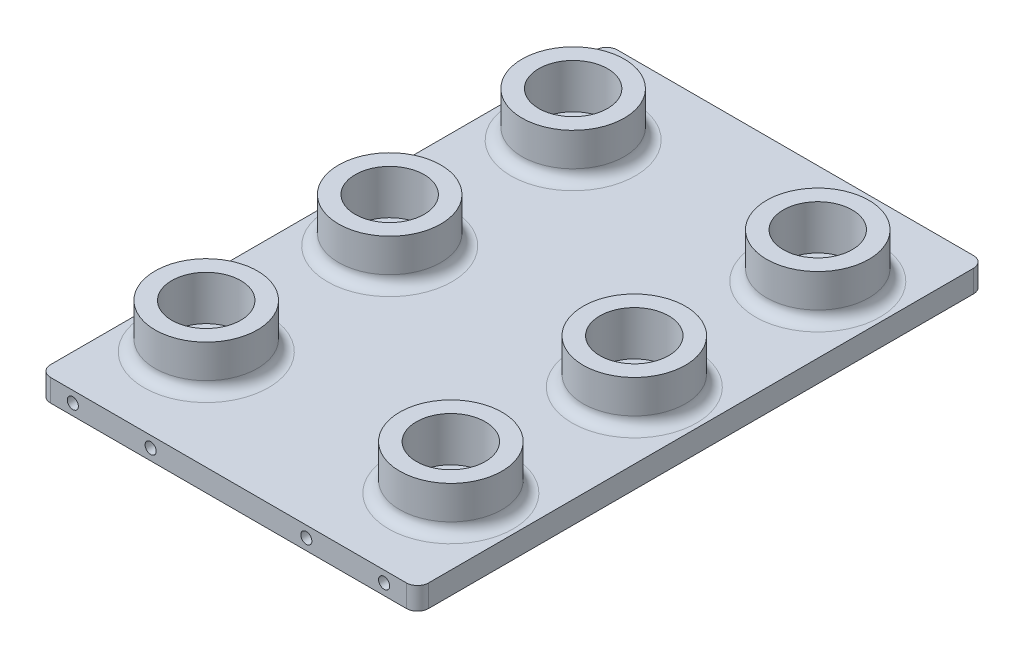
ISO-10303-21;
HEADER;
FILE_DESCRIPTION(('STEP AP214'),'2;1');
FILE_NAME('part.step','',(''),(''),'','','');
FILE_SCHEMA(('AUTOMOTIVE_DESIGN { 1 0 10303 214 1 1 1 1 }'));
ENDSEC;
DATA;
#1=APPLICATION_CONTEXT('core data for automotive mechanical design processes');
#2=APPLICATION_PROTOCOL_DEFINITION('international standard','automotive_design',2000,#1);
#3=PRODUCT_CONTEXT('',#1,'mechanical');
#4=PRODUCT('Part','Part','',(#3));
#5=PRODUCT_RELATED_PRODUCT_CATEGORY('part','',(#4));
#6=PRODUCT_DEFINITION_FORMATION('','',#4);
#7=PRODUCT_DEFINITION_CONTEXT('part definition',#1,'design');
#8=PRODUCT_DEFINITION('design','',#6,#7);
#9=PRODUCT_DEFINITION_SHAPE('','',#8);
#10=(LENGTH_UNIT() NAMED_UNIT(*) SI_UNIT(.MILLI.,.METRE.));
#11=(NAMED_UNIT(*) PLANE_ANGLE_UNIT() SI_UNIT($,.RADIAN.));
#12=(NAMED_UNIT(*) SI_UNIT($,.STERADIAN.) SOLID_ANGLE_UNIT());
#13=UNCERTAINTY_MEASURE_WITH_UNIT(LENGTH_MEASURE(1.E-05),#10,'distance_accuracy_value','');
#14=(GEOMETRIC_REPRESENTATION_CONTEXT(3) GLOBAL_UNCERTAINTY_ASSIGNED_CONTEXT((#13)) GLOBAL_UNIT_ASSIGNED_CONTEXT((#10,
#11,#12)) REPRESENTATION_CONTEXT('',''));
#15=CARTESIAN_POINT('',(0.,0.,0.));
#16=DIRECTION('',(0.,0.,1.));
#17=DIRECTION('',(1.,0.,0.));
#18=AXIS2_PLACEMENT_3D('',#15,#16,#17);
#19=CARTESIAN_POINT('',(21.59,2.54,-32.385));
#20=DIRECTION('',(-1.,0.,0.));
#21=DIRECTION('',(0.,0.,1.));
#22=AXIS2_PLACEMENT_3D('',#19,#20,#21);
#23=PLANE('',#22);
#24=DIRECTION('',(0.,0.,-1.));
#25=VECTOR('',#24,1.);
#26=CARTESIAN_POINT('',(21.59,0.,-32.385));
#27=LINE('',#26,#25);
#28=CARTESIAN_POINT('',(21.59,0.,31.115));
#29=VERTEX_POINT('',#28);
#30=CARTESIAN_POINT('',(21.59,0.,-31.115));
#31=VERTEX_POINT('',#30);
#32=EDGE_CURVE('E269',#29,#31,#27,.T.);
#33=ORIENTED_EDGE('',*,*,#32,.T.);
#34=DIRECTION('',(0.,-1.,0.));
#35=VECTOR('',#34,1.);
#36=CARTESIAN_POINT('',(21.59,2.54,-31.115));
#37=LINE('',#36,#35);
#38=CARTESIAN_POINT('',(21.59,2.54,-31.115));
#39=VERTEX_POINT('',#38);
#40=EDGE_CURVE('E124',#31,#39,#37,.F.);
#41=ORIENTED_EDGE('',*,*,#40,.T.);
#42=DIRECTION('',(0.,0.,-1.));
#43=VECTOR('',#42,1.);
#44=CARTESIAN_POINT('',(21.59,2.54,-32.385));
#45=LINE('',#44,#43);
#46=CARTESIAN_POINT('',(21.59,2.54,31.115));
#47=VERTEX_POINT('',#46);
#48=EDGE_CURVE('E108',#47,#39,#45,.T.);
#49=ORIENTED_EDGE('',*,*,#48,.F.);
#50=DIRECTION('',(0.,-1.,0.));
#51=VECTOR('',#50,1.);
#52=CARTESIAN_POINT('',(21.59,2.54,31.115));
#53=LINE('',#52,#51);
#54=EDGE_CURVE('E121',#47,#29,#53,.T.);
#55=ORIENTED_EDGE('',*,*,#54,.T.);
#56=EDGE_LOOP('',(#33,#41,#49,#55));
#57=FACE_BOUND('',#56,.T.);
#58=ADVANCED_FACE('F37',(#57),#23,.F.);
#59=CARTESIAN_POINT('',(-21.59,2.54,-32.385));
#60=DIRECTION('',(0.,0.,1.));
#61=DIRECTION('',(1.,0.,0.));
#62=AXIS2_PLACEMENT_3D('',#59,#60,#61);
#63=PLANE('',#62);
#64=CARTESIAN_POINT('',(-17.78,1.27,-32.385));
#65=DIRECTION('',(0.,0.,1.));
#66=DIRECTION('',(1.,0.,0.));
#67=AXIS2_PLACEMENT_3D('',#64,#65,#66);
#68=CIRCLE('',#67,0.634999999999999);
#69=CARTESIAN_POINT('',(-17.145,1.27,-32.385));
#70=VERTEX_POINT('',#69);
#71=EDGE_CURVE('E246',#70,#70,#68,.T.);
#72=ORIENTED_EDGE('',*,*,#71,.T.);
#73=EDGE_LOOP('',(#72));
#74=FACE_BOUND('',#73,.T.);
#75=CARTESIAN_POINT('',(-8.89,1.27,-32.385));
#76=DIRECTION('',(0.,0.,1.));
#77=DIRECTION('',(1.,0.,0.));
#78=AXIS2_PLACEMENT_3D('',#75,#76,#77);
#79=CIRCLE('',#78,0.635000000000001);
#80=CARTESIAN_POINT('',(-8.255,1.27,-32.385));
#81=VERTEX_POINT('',#80);
#82=EDGE_CURVE('E252',#81,#81,#79,.T.);
#83=ORIENTED_EDGE('',*,*,#82,.T.);
#84=EDGE_LOOP('',(#83));
#85=FACE_BOUND('',#84,.T.);
#86=CARTESIAN_POINT('',(8.89,1.27,-32.385));
#87=DIRECTION('',(0.,0.,1.));
#88=DIRECTION('',(1.,0.,0.));
#89=AXIS2_PLACEMENT_3D('',#86,#87,#88);
#90=CIRCLE('',#89,0.635000000000001);
#91=CARTESIAN_POINT('',(9.525,1.27,-32.385));
#92=VERTEX_POINT('',#91);
#93=EDGE_CURVE('E258',#92,#92,#90,.T.);
#94=ORIENTED_EDGE('',*,*,#93,.T.);
#95=EDGE_LOOP('',(#94));
#96=FACE_BOUND('',#95,.T.);
#97=CARTESIAN_POINT('',(17.78,1.27,-32.385));
#98=DIRECTION('',(0.,0.,1.));
#99=DIRECTION('',(1.,0.,0.));
#100=AXIS2_PLACEMENT_3D('',#97,#98,#99);
#101=CIRCLE('',#100,0.634999999999999);
#102=CARTESIAN_POINT('',(18.415,1.27,-32.385));
#103=VERTEX_POINT('',#102);
#104=EDGE_CURVE('E241',#103,#103,#101,.T.);
#105=ORIENTED_EDGE('',*,*,#104,.T.);
#106=EDGE_LOOP('',(#105));
#107=FACE_BOUND('',#106,.T.);
#108=DIRECTION('',(-1.,0.,0.));
#109=VECTOR('',#108,1.);
#110=CARTESIAN_POINT('',(-21.59,2.54,-32.385));
#111=LINE('',#110,#109);
#112=CARTESIAN_POINT('',(20.32,2.54,-32.385));
#113=VERTEX_POINT('',#112);
#114=CARTESIAN_POINT('',(-20.32,2.54,-32.385));
#115=VERTEX_POINT('',#114);
#116=EDGE_CURVE('E125',#113,#115,#111,.T.);
#117=ORIENTED_EDGE('',*,*,#116,.F.);
#118=DIRECTION('',(0.,-1.,0.));
#119=VECTOR('',#118,1.);
#120=CARTESIAN_POINT('',(20.32,2.54,-32.385));
#121=LINE('',#120,#119);
#122=CARTESIAN_POINT('',(20.32,0.,-32.385));
#123=VERTEX_POINT('',#122);
#124=EDGE_CURVE('E350',#113,#123,#121,.T.);
#125=ORIENTED_EDGE('',*,*,#124,.T.);
#126=DIRECTION('',(-1.,0.,0.));
#127=VECTOR('',#126,1.);
#128=CARTESIAN_POINT('',(-21.59,0.,-32.385));
#129=LINE('',#128,#127);
#130=CARTESIAN_POINT('',(-20.32,0.,-32.385));
#131=VERTEX_POINT('',#130);
#132=EDGE_CURVE('E298',#123,#131,#129,.T.);
#133=ORIENTED_EDGE('',*,*,#132,.T.);
#134=DIRECTION('',(0.,-1.,0.));
#135=VECTOR('',#134,1.);
#136=CARTESIAN_POINT('',(-20.32,2.54,-32.385));
#137=LINE('',#136,#135);
#138=EDGE_CURVE('E348',#131,#115,#137,.F.);
#139=ORIENTED_EDGE('',*,*,#138,.T.);
#140=EDGE_LOOP('',(#117,#125,#133,#139));
#141=FACE_BOUND('',#140,.T.);
#142=ADVANCED_FACE('F170',(#74,#85,#96,#107,#141),#63,.F.);
#143=CARTESIAN_POINT('',(-21.59,2.54,-32.385));
#144=DIRECTION('',(1.,0.,0.));
#145=DIRECTION('',(0.,0.,-1.));
#146=AXIS2_PLACEMENT_3D('',#143,#144,#145);
#147=PLANE('',#146);
#148=DIRECTION('',(0.,0.,1.));
#149=VECTOR('',#148,1.);
#150=CARTESIAN_POINT('',(-21.59,0.,-32.385));
#151=LINE('',#150,#149);
#152=CARTESIAN_POINT('',(-21.59,0.,-31.115));
#153=VERTEX_POINT('',#152);
#154=CARTESIAN_POINT('',(-21.59,0.,31.115));
#155=VERTEX_POINT('',#154);
#156=EDGE_CURVE('E301',#153,#155,#151,.T.);
#157=ORIENTED_EDGE('',*,*,#156,.T.);
#158=DIRECTION('',(0.,-1.,0.));
#159=VECTOR('',#158,1.);
#160=CARTESIAN_POINT('',(-21.59,2.54,31.115));
#161=LINE('',#160,#159);
#162=CARTESIAN_POINT('',(-21.59,2.54,31.115));
#163=VERTEX_POINT('',#162);
#164=EDGE_CURVE('E143',#155,#163,#161,.F.);
#165=ORIENTED_EDGE('',*,*,#164,.T.);
#166=DIRECTION('',(0.,0.,1.));
#167=VECTOR('',#166,1.);
#168=CARTESIAN_POINT('',(-21.59,2.54,-32.385));
#169=LINE('',#168,#167);
#170=CARTESIAN_POINT('',(-21.59,2.54,-31.115));
#171=VERTEX_POINT('',#170);
#172=EDGE_CURVE('E292',#171,#163,#169,.T.);
#173=ORIENTED_EDGE('',*,*,#172,.F.);
#174=DIRECTION('',(0.,-1.,0.));
#175=VECTOR('',#174,1.);
#176=CARTESIAN_POINT('',(-21.59,2.54,-31.115));
#177=LINE('',#176,#175);
#178=EDGE_CURVE('E141',#171,#153,#177,.T.);
#179=ORIENTED_EDGE('',*,*,#178,.T.);
#180=EDGE_LOOP('',(#157,#165,#173,#179));
#181=FACE_BOUND('',#180,.T.);
#182=ADVANCED_FACE('F175',(#181),#147,.F.);
#183=CARTESIAN_POINT('',(-21.59,2.54,32.385));
#184=DIRECTION('',(0.,0.,-1.));
#185=DIRECTION('',(-1.,0.,0.));
#186=AXIS2_PLACEMENT_3D('',#183,#184,#185);
#187=PLANE('',#186);
#188=CARTESIAN_POINT('',(-17.78,1.27,32.385));
#189=DIRECTION('',(0.,0.,1.));
#190=DIRECTION('',(1.,0.,0.));
#191=AXIS2_PLACEMENT_3D('',#188,#189,#190);
#192=CIRCLE('',#191,0.634999999999999);
#193=CARTESIAN_POINT('',(-17.145,1.27,32.385));
#194=VERTEX_POINT('',#193);
#195=EDGE_CURVE('E270',#194,#194,#192,.T.);
#196=ORIENTED_EDGE('',*,*,#195,.F.);
#197=EDGE_LOOP('',(#196));
#198=FACE_BOUND('',#197,.T.);
#199=CARTESIAN_POINT('',(-8.89,1.27,32.385));
#200=DIRECTION('',(0.,0.,1.));
#201=DIRECTION('',(1.,0.,0.));
#202=AXIS2_PLACEMENT_3D('',#199,#200,#201);
#203=CIRCLE('',#202,0.635000000000001);
#204=CARTESIAN_POINT('',(-8.255,1.27,32.385));
#205=VERTEX_POINT('',#204);
#206=EDGE_CURVE('E276',#205,#205,#203,.T.);
#207=ORIENTED_EDGE('',*,*,#206,.F.);
#208=EDGE_LOOP('',(#207));
#209=FACE_BOUND('',#208,.T.);
#210=CARTESIAN_POINT('',(8.89,1.27,32.385));
#211=DIRECTION('',(0.,0.,1.));
#212=DIRECTION('',(1.,0.,0.));
#213=AXIS2_PLACEMENT_3D('',#210,#211,#212);
#214=CIRCLE('',#213,0.635000000000001);
#215=CARTESIAN_POINT('',(9.525,1.27,32.385));
#216=VERTEX_POINT('',#215);
#217=EDGE_CURVE('E282',#216,#216,#214,.T.);
#218=ORIENTED_EDGE('',*,*,#217,.F.);
#219=EDGE_LOOP('',(#218));
#220=FACE_BOUND('',#219,.T.);
#221=CARTESIAN_POINT('',(17.78,1.27,32.385));
#222=DIRECTION('',(0.,0.,1.));
#223=DIRECTION('',(1.,0.,0.));
#224=AXIS2_PLACEMENT_3D('',#221,#222,#223);
#225=CIRCLE('',#224,0.634999999999999);
#226=CARTESIAN_POINT('',(18.415,1.27,32.385));
#227=VERTEX_POINT('',#226);
#228=EDGE_CURVE('E245',#227,#227,#225,.T.);
#229=ORIENTED_EDGE('',*,*,#228,.F.);
#230=EDGE_LOOP('',(#229));
#231=FACE_BOUND('',#230,.T.);
#232=DIRECTION('',(1.,0.,0.));
#233=VECTOR('',#232,1.);
#234=CARTESIAN_POINT('',(-21.59,0.,32.385));
#235=LINE('',#234,#233);
#236=CARTESIAN_POINT('',(-20.32,0.,32.385));
#237=VERTEX_POINT('',#236);
#238=CARTESIAN_POINT('',(20.32,0.,32.385));
#239=VERTEX_POINT('',#238);
#240=EDGE_CURVE('E126',#237,#239,#235,.T.);
#241=ORIENTED_EDGE('',*,*,#240,.T.);
#242=DIRECTION('',(0.,-1.,0.));
#243=VECTOR('',#242,1.);
#244=CARTESIAN_POINT('',(20.32,2.54,32.385));
#245=LINE('',#244,#243);
#246=CARTESIAN_POINT('',(20.32,2.54,32.385));
#247=VERTEX_POINT('',#246);
#248=EDGE_CURVE('E139',#239,#247,#245,.F.);
#249=ORIENTED_EDGE('',*,*,#248,.T.);
#250=DIRECTION('',(1.,0.,0.));
#251=VECTOR('',#250,1.);
#252=CARTESIAN_POINT('',(-21.59,2.54,32.385));
#253=LINE('',#252,#251);
#254=CARTESIAN_POINT('',(-20.32,2.54,32.385));
#255=VERTEX_POINT('',#254);
#256=EDGE_CURVE('E111',#255,#247,#253,.T.);
#257=ORIENTED_EDGE('',*,*,#256,.F.);
#258=DIRECTION('',(0.,-1.,0.));
#259=VECTOR('',#258,1.);
#260=CARTESIAN_POINT('',(-20.32,2.54,32.385));
#261=LINE('',#260,#259);
#262=EDGE_CURVE('E132',#255,#237,#261,.T.);
#263=ORIENTED_EDGE('',*,*,#262,.T.);
#264=EDGE_LOOP('',(#241,#249,#257,#263));
#265=FACE_BOUND('',#264,.T.);
#266=ADVANCED_FACE('F357',(#198,#209,#220,#231,#265),#187,.F.);
#267=CARTESIAN_POINT('',(0.,2.54,0.));
#268=DIRECTION('',(0.,1.,0.));
#269=DIRECTION('',(0.,0.,1.));
#270=AXIS2_PLACEMENT_3D('',#267,#268,#269);
#271=PLANE('',#270);
#272=CARTESIAN_POINT('',(13.97,2.54,0.));
#273=DIRECTION('',(0.,1.,0.));
#274=DIRECTION('',(0.,0.,1.));
#275=AXIS2_PLACEMENT_3D('',#272,#273,#274);
#276=CIRCLE('',#275,7.112);
#277=CARTESIAN_POINT('',(13.97,2.54,7.11199999999999));
#278=VERTEX_POINT('',#277);
#279=EDGE_CURVE('E342',#278,#278,#276,.F.);
#280=ORIENTED_EDGE('',*,*,#279,.T.);
#281=EDGE_LOOP('',(#280));
#282=FACE_BOUND('',#281,.T.);
#283=CARTESIAN_POINT('',(-13.97,2.54,0.));
#284=DIRECTION('',(0.,1.,0.));
#285=DIRECTION('',(0.,0.,1.));
#286=AXIS2_PLACEMENT_3D('',#283,#284,#285);
#287=CIRCLE('',#286,7.112);
#288=CARTESIAN_POINT('',(-13.97,2.54,7.112));
#289=VERTEX_POINT('',#288);
#290=EDGE_CURVE('E339',#289,#289,#287,.F.);
#291=ORIENTED_EDGE('',*,*,#290,.T.);
#292=EDGE_LOOP('',(#291));
#293=FACE_BOUND('',#292,.T.);
#294=CARTESIAN_POINT('',(13.97,2.54,20.955));
#295=DIRECTION('',(0.,1.,0.));
#296=DIRECTION('',(0.,0.,1.));
#297=AXIS2_PLACEMENT_3D('',#294,#295,#296);
#298=CIRCLE('',#297,7.112);
#299=CARTESIAN_POINT('',(13.97,2.54,28.067));
#300=VERTEX_POINT('',#299);
#301=EDGE_CURVE('E209',#300,#300,#298,.F.);
#302=ORIENTED_EDGE('',*,*,#301,.T.);
#303=EDGE_LOOP('',(#302));
#304=FACE_BOUND('',#303,.T.);
#305=CARTESIAN_POINT('',(13.97,2.54,-20.955));
#306=DIRECTION('',(0.,1.,0.));
#307=DIRECTION('',(0.,0.,1.));
#308=AXIS2_PLACEMENT_3D('',#305,#306,#307);
#309=CIRCLE('',#308,7.112);
#310=CARTESIAN_POINT('',(13.97,2.54,-13.843));
#311=VERTEX_POINT('',#310);
#312=EDGE_CURVE('E331',#311,#311,#309,.F.);
#313=ORIENTED_EDGE('',*,*,#312,.T.);
#314=EDGE_LOOP('',(#313));
#315=FACE_BOUND('',#314,.T.);
#316=CARTESIAN_POINT('',(-13.97,2.54,-20.955));
#317=DIRECTION('',(0.,1.,0.));
#318=DIRECTION('',(0.,0.,1.));
#319=AXIS2_PLACEMENT_3D('',#316,#317,#318);
#320=CIRCLE('',#319,7.112);
#321=CARTESIAN_POINT('',(-13.97,2.54,-13.843));
#322=VERTEX_POINT('',#321);
#323=EDGE_CURVE('E328',#322,#322,#320,.F.);
#324=ORIENTED_EDGE('',*,*,#323,.T.);
#325=EDGE_LOOP('',(#324));
#326=FACE_BOUND('',#325,.T.);
#327=CARTESIAN_POINT('',(-13.97,2.54,20.955));
#328=DIRECTION('',(0.,1.,0.));
#329=DIRECTION('',(0.,0.,1.));
#330=AXIS2_PLACEMENT_3D('',#327,#328,#329);
#331=CIRCLE('',#330,7.112);
#332=CARTESIAN_POINT('',(-13.97,2.54,28.067));
#333=VERTEX_POINT('',#332);
#334=EDGE_CURVE('E325',#333,#333,#331,.F.);
#335=ORIENTED_EDGE('',*,*,#334,.T.);
#336=EDGE_LOOP('',(#335));
#337=FACE_BOUND('',#336,.T.);
#338=ORIENTED_EDGE('',*,*,#48,.T.);
#339=CARTESIAN_POINT('',(20.32,2.54,-31.115));
#340=DIRECTION('',(0.,1.,0.));
#341=DIRECTION('',(0.,0.,1.));
#342=AXIS2_PLACEMENT_3D('',#339,#340,#341);
#343=CIRCLE('',#342,1.27);
#344=EDGE_CURVE('E115',#39,#113,#343,.T.);
#345=ORIENTED_EDGE('',*,*,#344,.T.);
#346=ORIENTED_EDGE('',*,*,#116,.T.);
#347=CARTESIAN_POINT('',(-20.32,2.54,-31.115));
#348=DIRECTION('',(0.,1.,0.));
#349=DIRECTION('',(0.,0.,1.));
#350=AXIS2_PLACEMENT_3D('',#347,#348,#349);
#351=CIRCLE('',#350,1.27);
#352=EDGE_CURVE('E335',#115,#171,#351,.T.);
#353=ORIENTED_EDGE('',*,*,#352,.T.);
#354=ORIENTED_EDGE('',*,*,#172,.T.);
#355=CARTESIAN_POINT('',(-20.32,2.54,31.115));
#356=DIRECTION('',(0.,1.,0.));
#357=DIRECTION('',(0.,0.,1.));
#358=AXIS2_PLACEMENT_3D('',#355,#356,#357);
#359=CIRCLE('',#358,1.27);
#360=EDGE_CURVE('E116',#163,#255,#359,.T.);
#361=ORIENTED_EDGE('',*,*,#360,.T.);
#362=ORIENTED_EDGE('',*,*,#256,.T.);
#363=CARTESIAN_POINT('',(20.32,2.54,31.115));
#364=DIRECTION('',(0.,1.,0.));
#365=DIRECTION('',(0.,0.,1.));
#366=AXIS2_PLACEMENT_3D('',#363,#364,#365);
#367=CIRCLE('',#366,1.27);
#368=EDGE_CURVE('E105',#247,#47,#367,.T.);
#369=ORIENTED_EDGE('',*,*,#368,.T.);
#370=EDGE_LOOP('',(#338,#345,#346,#353,#354,#361,#362,#369));
#371=FACE_BOUND('',#370,.T.);
#372=ADVANCED_FACE('F107',(#282,#293,#304,#315,#326,#337,#371),#271,.T.);
#373=CARTESIAN_POINT('',(0.,0.,0.));
#374=DIRECTION('',(0.,1.,0.));
#375=DIRECTION('',(0.,0.,1.));
#376=AXIS2_PLACEMENT_3D('',#373,#374,#375);
#377=PLANE('',#376);
#378=ORIENTED_EDGE('',*,*,#132,.F.);
#379=CARTESIAN_POINT('',(20.32,0.,-31.115));
#380=DIRECTION('',(0.,1.,0.));
#381=DIRECTION('',(0.,0.,1.));
#382=AXIS2_PLACEMENT_3D('',#379,#380,#381);
#383=CIRCLE('',#382,1.27);
#384=EDGE_CURVE('E130',#123,#31,#383,.F.);
#385=ORIENTED_EDGE('',*,*,#384,.T.);
#386=ORIENTED_EDGE('',*,*,#32,.F.);
#387=CARTESIAN_POINT('',(20.32,0.,31.115));
#388=DIRECTION('',(0.,1.,0.));
#389=DIRECTION('',(0.,0.,1.));
#390=AXIS2_PLACEMENT_3D('',#387,#388,#389);
#391=CIRCLE('',#390,1.27);
#392=EDGE_CURVE('E129',#29,#239,#391,.F.);
#393=ORIENTED_EDGE('',*,*,#392,.T.);
#394=ORIENTED_EDGE('',*,*,#240,.F.);
#395=CARTESIAN_POINT('',(-20.32,0.,31.115));
#396=DIRECTION('',(0.,1.,0.));
#397=DIRECTION('',(0.,0.,1.));
#398=AXIS2_PLACEMENT_3D('',#395,#396,#397);
#399=CIRCLE('',#398,1.27);
#400=EDGE_CURVE('E52',#237,#155,#399,.F.);
#401=ORIENTED_EDGE('',*,*,#400,.T.);
#402=ORIENTED_EDGE('',*,*,#156,.F.);
#403=CARTESIAN_POINT('',(-20.32,0.,-31.115));
#404=DIRECTION('',(0.,1.,0.));
#405=DIRECTION('',(0.,0.,1.));
#406=AXIS2_PLACEMENT_3D('',#403,#404,#405);
#407=CIRCLE('',#406,1.27);
#408=EDGE_CURVE('E60',#153,#131,#407,.F.);
#409=ORIENTED_EDGE('',*,*,#408,.T.);
#410=EDGE_LOOP('',(#378,#385,#386,#393,#394,#401,#402,#409));
#411=FACE_BOUND('',#410,.T.);
#412=ADVANCED_FACE('F355',(#411),#377,.F.);
#413=CARTESIAN_POINT('',(17.78,1.27,29.845));
#414=DIRECTION('',(0.,0.,1.));
#415=DIRECTION('',(1.,0.,0.));
#416=AXIS2_PLACEMENT_3D('',#413,#414,#415);
#417=CYLINDRICAL_SURFACE('',#416,0.634999999999999);
#418=CARTESIAN_POINT('',(17.78,1.27,29.845));
#419=DIRECTION('',(0.,0.,1.));
#420=DIRECTION('',(1.,0.,0.));
#421=AXIS2_PLACEMENT_3D('',#418,#419,#420);
#422=CIRCLE('',#421,0.634999999999999);
#423=CARTESIAN_POINT('',(18.415,1.27,29.845));
#424=VERTEX_POINT('',#423);
#425=EDGE_CURVE('E285',#424,#424,#422,.T.);
#426=ORIENTED_EDGE('',*,*,#425,.F.);
#427=EDGE_LOOP('',(#426));
#428=FACE_BOUND('',#427,.T.);
#429=ORIENTED_EDGE('',*,*,#228,.T.);
#430=EDGE_LOOP('',(#429));
#431=FACE_BOUND('',#430,.T.);
#432=ADVANCED_FACE('F376',(#428,#431),#417,.F.);
#433=CARTESIAN_POINT('',(17.78,1.27,29.845));
#434=DIRECTION('',(0.,0.,1.));
#435=DIRECTION('',(1.,0.,0.));
#436=AXIS2_PLACEMENT_3D('',#433,#434,#435);
#437=PLANE('',#436);
#438=ORIENTED_EDGE('',*,*,#425,.T.);
#439=EDGE_LOOP('',(#438));
#440=FACE_BOUND('',#439,.T.);
#441=ADVANCED_FACE('F383',(#440),#437,.T.);
#442=CARTESIAN_POINT('',(8.89,1.27,29.845));
#443=DIRECTION('',(0.,0.,1.));
#444=DIRECTION('',(1.,0.,0.));
#445=AXIS2_PLACEMENT_3D('',#442,#443,#444);
#446=CYLINDRICAL_SURFACE('',#445,0.635000000000001);
#447=CARTESIAN_POINT('',(8.89,1.27,29.845));
#448=DIRECTION('',(0.,0.,1.));
#449=DIRECTION('',(1.,0.,0.));
#450=AXIS2_PLACEMENT_3D('',#447,#448,#449);
#451=CIRCLE('',#450,0.635000000000001);
#452=CARTESIAN_POINT('',(9.525,1.27,29.845));
#453=VERTEX_POINT('',#452);
#454=EDGE_CURVE('E279',#453,#453,#451,.T.);
#455=ORIENTED_EDGE('',*,*,#454,.F.);
#456=EDGE_LOOP('',(#455));
#457=FACE_BOUND('',#456,.T.);
#458=ORIENTED_EDGE('',*,*,#217,.T.);
#459=EDGE_LOOP('',(#458));
#460=FACE_BOUND('',#459,.T.);
#461=ADVANCED_FACE('F387',(#457,#460),#446,.F.);
#462=CARTESIAN_POINT('',(8.89,1.27,29.845));
#463=DIRECTION('',(0.,0.,1.));
#464=DIRECTION('',(1.,0.,0.));
#465=AXIS2_PLACEMENT_3D('',#462,#463,#464);
#466=PLANE('',#465);
#467=ORIENTED_EDGE('',*,*,#454,.T.);
#468=EDGE_LOOP('',(#467));
#469=FACE_BOUND('',#468,.T.);
#470=ADVANCED_FACE('F391',(#469),#466,.T.);
#471=CARTESIAN_POINT('',(-8.89,1.27,29.845));
#472=DIRECTION('',(0.,0.,1.));
#473=DIRECTION('',(1.,0.,0.));
#474=AXIS2_PLACEMENT_3D('',#471,#472,#473);
#475=CYLINDRICAL_SURFACE('',#474,0.635000000000001);
#476=CARTESIAN_POINT('',(-8.89,1.27,29.845));
#477=DIRECTION('',(0.,0.,1.));
#478=DIRECTION('',(1.,0.,0.));
#479=AXIS2_PLACEMENT_3D('',#476,#477,#478);
#480=CIRCLE('',#479,0.635000000000001);
#481=CARTESIAN_POINT('',(-8.255,1.27,29.845));
#482=VERTEX_POINT('',#481);
#483=EDGE_CURVE('E273',#482,#482,#480,.T.);
#484=ORIENTED_EDGE('',*,*,#483,.F.);
#485=EDGE_LOOP('',(#484));
#486=FACE_BOUND('',#485,.T.);
#487=ORIENTED_EDGE('',*,*,#206,.T.);
#488=EDGE_LOOP('',(#487));
#489=FACE_BOUND('',#488,.T.);
#490=ADVANCED_FACE('F395',(#486,#489),#475,.F.);
#491=CARTESIAN_POINT('',(-8.89,1.27,29.845));
#492=DIRECTION('',(0.,0.,1.));
#493=DIRECTION('',(1.,0.,0.));
#494=AXIS2_PLACEMENT_3D('',#491,#492,#493);
#495=PLANE('',#494);
#496=ORIENTED_EDGE('',*,*,#483,.T.);
#497=EDGE_LOOP('',(#496));
#498=FACE_BOUND('',#497,.T.);
#499=ADVANCED_FACE('F399',(#498),#495,.T.);
#500=CARTESIAN_POINT('',(-17.78,1.27,29.845));
#501=DIRECTION('',(0.,0.,1.));
#502=DIRECTION('',(1.,0.,0.));
#503=AXIS2_PLACEMENT_3D('',#500,#501,#502);
#504=CYLINDRICAL_SURFACE('',#503,0.634999999999999);
#505=CARTESIAN_POINT('',(-17.78,1.27,29.845));
#506=DIRECTION('',(0.,0.,1.));
#507=DIRECTION('',(1.,0.,0.));
#508=AXIS2_PLACEMENT_3D('',#505,#506,#507);
#509=CIRCLE('',#508,0.634999999999999);
#510=CARTESIAN_POINT('',(-17.145,1.27,29.845));
#511=VERTEX_POINT('',#510);
#512=EDGE_CURVE('E266',#511,#511,#509,.T.);
#513=ORIENTED_EDGE('',*,*,#512,.F.);
#514=EDGE_LOOP('',(#513));
#515=FACE_BOUND('',#514,.T.);
#516=ORIENTED_EDGE('',*,*,#195,.T.);
#517=EDGE_LOOP('',(#516));
#518=FACE_BOUND('',#517,.T.);
#519=ADVANCED_FACE('F403',(#515,#518),#504,.F.);
#520=CARTESIAN_POINT('',(-17.78,1.27,29.845));
#521=DIRECTION('',(0.,0.,1.));
#522=DIRECTION('',(1.,0.,0.));
#523=AXIS2_PLACEMENT_3D('',#520,#521,#522);
#524=PLANE('',#523);
#525=ORIENTED_EDGE('',*,*,#512,.T.);
#526=EDGE_LOOP('',(#525));
#527=FACE_BOUND('',#526,.T.);
#528=ADVANCED_FACE('F407',(#527),#524,.T.);
#529=CARTESIAN_POINT('',(17.78,1.27,-29.845));
#530=DIRECTION('',(0.,0.,-1.));
#531=DIRECTION('',(-1.,0.,0.));
#532=AXIS2_PLACEMENT_3D('',#529,#530,#531);
#533=CYLINDRICAL_SURFACE('',#532,0.634999999999999);
#534=CARTESIAN_POINT('',(17.78,1.27,-29.845));
#535=DIRECTION('',(0.,0.,1.));
#536=DIRECTION('',(1.,0.,0.));
#537=AXIS2_PLACEMENT_3D('',#534,#535,#536);
#538=CIRCLE('',#537,0.634999999999999);
#539=CARTESIAN_POINT('',(18.415,1.27,-29.845));
#540=VERTEX_POINT('',#539);
#541=EDGE_CURVE('E261',#540,#540,#538,.T.);
#542=ORIENTED_EDGE('',*,*,#541,.T.);
#543=EDGE_LOOP('',(#542));
#544=FACE_BOUND('',#543,.T.);
#545=ORIENTED_EDGE('',*,*,#104,.F.);
#546=EDGE_LOOP('',(#545));
#547=FACE_BOUND('',#546,.T.);
#548=ADVANCED_FACE('F411',(#544,#547),#533,.F.);
#549=CARTESIAN_POINT('',(17.78,1.27,-29.845));
#550=DIRECTION('',(0.,0.,-1.));
#551=DIRECTION('',(1.,0.,0.));
#552=AXIS2_PLACEMENT_3D('',#549,#550,#551);
#553=PLANE('',#552);
#554=ORIENTED_EDGE('',*,*,#541,.F.);
#555=EDGE_LOOP('',(#554));
#556=FACE_BOUND('',#555,.T.);
#557=ADVANCED_FACE('F415',(#556),#553,.T.);
#558=CARTESIAN_POINT('',(8.89,1.27,-29.845));
#559=DIRECTION('',(0.,0.,-1.));
#560=DIRECTION('',(-1.,0.,0.));
#561=AXIS2_PLACEMENT_3D('',#558,#559,#560);
#562=CYLINDRICAL_SURFACE('',#561,0.635000000000001);
#563=CARTESIAN_POINT('',(8.89,1.27,-29.845));
#564=DIRECTION('',(0.,0.,1.));
#565=DIRECTION('',(1.,0.,0.));
#566=AXIS2_PLACEMENT_3D('',#563,#564,#565);
#567=CIRCLE('',#566,0.635000000000001);
#568=CARTESIAN_POINT('',(9.525,1.27,-29.845));
#569=VERTEX_POINT('',#568);
#570=EDGE_CURVE('E255',#569,#569,#567,.T.);
#571=ORIENTED_EDGE('',*,*,#570,.T.);
#572=EDGE_LOOP('',(#571));
#573=FACE_BOUND('',#572,.T.);
#574=ORIENTED_EDGE('',*,*,#93,.F.);
#575=EDGE_LOOP('',(#574));
#576=FACE_BOUND('',#575,.T.);
#577=ADVANCED_FACE('F419',(#573,#576),#562,.F.);
#578=CARTESIAN_POINT('',(8.89,1.27,-29.845));
#579=DIRECTION('',(0.,0.,-1.));
#580=DIRECTION('',(1.,0.,0.));
#581=AXIS2_PLACEMENT_3D('',#578,#579,#580);
#582=PLANE('',#581);
#583=ORIENTED_EDGE('',*,*,#570,.F.);
#584=EDGE_LOOP('',(#583));
#585=FACE_BOUND('',#584,.T.);
#586=ADVANCED_FACE('F423',(#585),#582,.T.);
#587=CARTESIAN_POINT('',(-8.89,1.27,-29.845));
#588=DIRECTION('',(0.,0.,-1.));
#589=DIRECTION('',(-1.,0.,0.));
#590=AXIS2_PLACEMENT_3D('',#587,#588,#589);
#591=CYLINDRICAL_SURFACE('',#590,0.635000000000001);
#592=CARTESIAN_POINT('',(-8.89,1.27,-29.845));
#593=DIRECTION('',(0.,0.,1.));
#594=DIRECTION('',(1.,0.,0.));
#595=AXIS2_PLACEMENT_3D('',#592,#593,#594);
#596=CIRCLE('',#595,0.635000000000001);
#597=CARTESIAN_POINT('',(-8.255,1.27,-29.845));
#598=VERTEX_POINT('',#597);
#599=EDGE_CURVE('E249',#598,#598,#596,.T.);
#600=ORIENTED_EDGE('',*,*,#599,.T.);
#601=EDGE_LOOP('',(#600));
#602=FACE_BOUND('',#601,.T.);
#603=ORIENTED_EDGE('',*,*,#82,.F.);
#604=EDGE_LOOP('',(#603));
#605=FACE_BOUND('',#604,.T.);
#606=ADVANCED_FACE('F427',(#602,#605),#591,.F.);
#607=CARTESIAN_POINT('',(-8.89,1.27,-29.845));
#608=DIRECTION('',(0.,0.,-1.));
#609=DIRECTION('',(1.,0.,0.));
#610=AXIS2_PLACEMENT_3D('',#607,#608,#609);
#611=PLANE('',#610);
#612=ORIENTED_EDGE('',*,*,#599,.F.);
#613=EDGE_LOOP('',(#612));
#614=FACE_BOUND('',#613,.T.);
#615=ADVANCED_FACE('F431',(#614),#611,.T.);
#616=CARTESIAN_POINT('',(-17.78,1.27,-29.845));
#617=DIRECTION('',(0.,0.,-1.));
#618=DIRECTION('',(-1.,0.,0.));
#619=AXIS2_PLACEMENT_3D('',#616,#617,#618);
#620=CYLINDRICAL_SURFACE('',#619,0.634999999999999);
#621=CARTESIAN_POINT('',(-17.78,1.27,-29.845));
#622=DIRECTION('',(0.,0.,1.));
#623=DIRECTION('',(1.,0.,0.));
#624=AXIS2_PLACEMENT_3D('',#621,#622,#623);
#625=CIRCLE('',#624,0.634999999999999);
#626=CARTESIAN_POINT('',(-17.145,1.27,-29.845));
#627=VERTEX_POINT('',#626);
#628=EDGE_CURVE('E242',#627,#627,#625,.T.);
#629=ORIENTED_EDGE('',*,*,#628,.T.);
#630=EDGE_LOOP('',(#629));
#631=FACE_BOUND('',#630,.T.);
#632=ORIENTED_EDGE('',*,*,#71,.F.);
#633=EDGE_LOOP('',(#632));
#634=FACE_BOUND('',#633,.T.);
#635=ADVANCED_FACE('F435',(#631,#634),#620,.F.);
#636=CARTESIAN_POINT('',(-17.78,1.27,-29.845));
#637=DIRECTION('',(0.,0.,-1.));
#638=DIRECTION('',(1.,0.,0.));
#639=AXIS2_PLACEMENT_3D('',#636,#637,#638);
#640=PLANE('',#639);
#641=ORIENTED_EDGE('',*,*,#628,.F.);
#642=EDGE_LOOP('',(#641));
#643=FACE_BOUND('',#642,.T.);
#644=ADVANCED_FACE('F439',(#643),#640,.T.);
#645=CARTESIAN_POINT('',(13.97,7.62,-20.955));
#646=DIRECTION('',(0.,1.,0.));
#647=DIRECTION('',(0.,0.,1.));
#648=AXIS2_PLACEMENT_3D('',#645,#646,#647);
#649=PLANE('',#648);
#650=CARTESIAN_POINT('',(13.97,7.62,-20.955));
#651=DIRECTION('',(0.,1.,0.));
#652=DIRECTION('',(0.,0.,1.));
#653=AXIS2_PLACEMENT_3D('',#650,#651,#652);
#654=CIRCLE('',#653,5.842);
#655=CARTESIAN_POINT('',(13.97,7.62,-15.113));
#656=VERTEX_POINT('',#655);
#657=EDGE_CURVE('E238',#656,#656,#654,.T.);
#658=ORIENTED_EDGE('',*,*,#657,.T.);
#659=EDGE_LOOP('',(#658));
#660=FACE_BOUND('',#659,.T.);
#661=CARTESIAN_POINT('',(13.97,7.62,-20.955));
#662=DIRECTION('',(0.,1.,0.));
#663=DIRECTION('',(0.,0.,1.));
#664=AXIS2_PLACEMENT_3D('',#661,#662,#663);
#665=CIRCLE('',#664,3.937);
#666=CARTESIAN_POINT('',(13.97,7.62,-17.018));
#667=VERTEX_POINT('',#666);
#668=EDGE_CURVE('E235',#667,#667,#665,.T.);
#669=ORIENTED_EDGE('',*,*,#668,.F.);
#670=EDGE_LOOP('',(#669));
#671=FACE_BOUND('',#670,.T.);
#672=ADVANCED_FACE('F443',(#660,#671),#649,.T.);
#673=CARTESIAN_POINT('',(13.97,7.62,-20.955));
#674=DIRECTION('',(0.,-1.,0.));
#675=DIRECTION('',(0.,0.,-1.));
#676=AXIS2_PLACEMENT_3D('',#673,#674,#675);
#677=CYLINDRICAL_SURFACE('',#676,5.842);
#678=CARTESIAN_POINT('',(13.97,3.81,-20.955));
#679=DIRECTION('',(0.,1.,0.));
#680=DIRECTION('',(0.,0.,1.));
#681=AXIS2_PLACEMENT_3D('',#678,#679,#680);
#682=CIRCLE('',#681,5.842);
#683=CARTESIAN_POINT('',(13.97,3.81,-15.113));
#684=VERTEX_POINT('',#683);
#685=EDGE_CURVE('E148',#684,#684,#682,.T.);
#686=ORIENTED_EDGE('',*,*,#685,.T.);
#687=EDGE_LOOP('',(#686));
#688=FACE_BOUND('',#687,.T.);
#689=ORIENTED_EDGE('',*,*,#657,.F.);
#690=EDGE_LOOP('',(#689));
#691=FACE_BOUND('',#690,.T.);
#692=ADVANCED_FACE('F445',(#688,#691),#677,.T.);
#693=CARTESIAN_POINT('',(13.97,7.62,-20.955));
#694=DIRECTION('',(0.,-1.,0.));
#695=DIRECTION('',(0.,0.,-1.));
#696=AXIS2_PLACEMENT_3D('',#693,#694,#695);
#697=CYLINDRICAL_SURFACE('',#696,3.937);
#698=ORIENTED_EDGE('',*,*,#668,.T.);
#699=EDGE_LOOP('',(#698));
#700=FACE_BOUND('',#699,.T.);
#701=CARTESIAN_POINT('',(13.97,2.54,-20.955));
#702=DIRECTION('',(0.,1.,0.));
#703=DIRECTION('',(0.,0.,1.));
#704=AXIS2_PLACEMENT_3D('',#701,#702,#703);
#705=CIRCLE('',#704,3.937);
#706=CARTESIAN_POINT('',(13.97,2.54,-17.018));
#707=VERTEX_POINT('',#706);
#708=EDGE_CURVE('E296',#707,#707,#705,.F.);
#709=ORIENTED_EDGE('',*,*,#708,.T.);
#710=EDGE_LOOP('',(#709));
#711=FACE_BOUND('',#710,.T.);
#712=ADVANCED_FACE('F448',(#700,#711),#697,.F.);
#713=ORIENTED_EDGE('',*,*,#708,.F.);
#714=EDGE_LOOP('',(#713));
#715=FACE_BOUND('',#714,.T.);
#716=ADVANCED_FACE('F380',(#715),#271,.T.);
#717=CARTESIAN_POINT('',(-13.97,7.62,-20.955));
#718=DIRECTION('',(0.,1.,0.));
#719=DIRECTION('',(0.,0.,1.));
#720=AXIS2_PLACEMENT_3D('',#717,#718,#719);
#721=PLANE('',#720);
#722=CARTESIAN_POINT('',(-13.97,7.62,-20.955));
#723=DIRECTION('',(0.,1.,0.));
#724=DIRECTION('',(0.,0.,1.));
#725=AXIS2_PLACEMENT_3D('',#722,#723,#724);
#726=CIRCLE('',#725,5.842);
#727=CARTESIAN_POINT('',(-13.97,7.62,-15.113));
#728=VERTEX_POINT('',#727);
#729=EDGE_CURVE('E226',#728,#728,#726,.T.);
#730=ORIENTED_EDGE('',*,*,#729,.T.);
#731=EDGE_LOOP('',(#730));
#732=FACE_BOUND('',#731,.T.);
#733=CARTESIAN_POINT('',(-13.97,7.62,-20.955));
#734=DIRECTION('',(0.,1.,0.));
#735=DIRECTION('',(0.,0.,1.));
#736=AXIS2_PLACEMENT_3D('',#733,#734,#735);
#737=CIRCLE('',#736,3.937);
#738=CARTESIAN_POINT('',(-13.97,7.62,-17.018));
#739=VERTEX_POINT('',#738);
#740=EDGE_CURVE('E222',#739,#739,#737,.T.);
#741=ORIENTED_EDGE('',*,*,#740,.F.);
#742=EDGE_LOOP('',(#741));
#743=FACE_BOUND('',#742,.T.);
#744=ADVANCED_FACE('F459',(#732,#743),#721,.T.);
#745=CARTESIAN_POINT('',(-13.97,7.62,-20.955));
#746=DIRECTION('',(0.,-1.,0.));
#747=DIRECTION('',(0.,0.,-1.));
#748=AXIS2_PLACEMENT_3D('',#745,#746,#747);
#749=CYLINDRICAL_SURFACE('',#748,5.842);
#750=CARTESIAN_POINT('',(-13.97,3.81,-20.955));
#751=DIRECTION('',(0.,1.,0.));
#752=DIRECTION('',(0.,0.,1.));
#753=AXIS2_PLACEMENT_3D('',#750,#751,#752);
#754=CIRCLE('',#753,5.842);
#755=CARTESIAN_POINT('',(-13.97,3.81,-15.113));
#756=VERTEX_POINT('',#755);
#757=EDGE_CURVE('E45',#756,#756,#754,.T.);
#758=ORIENTED_EDGE('',*,*,#757,.T.);
#759=EDGE_LOOP('',(#758));
#760=FACE_BOUND('',#759,.T.);
#761=ORIENTED_EDGE('',*,*,#729,.F.);
#762=EDGE_LOOP('',(#761));
#763=FACE_BOUND('',#762,.T.);
#764=ADVANCED_FACE('F153',(#760,#763),#749,.T.);
#765=CARTESIAN_POINT('',(-13.97,7.62,-20.955));
#766=DIRECTION('',(0.,-1.,0.));
#767=DIRECTION('',(0.,0.,-1.));
#768=AXIS2_PLACEMENT_3D('',#765,#766,#767);
#769=CYLINDRICAL_SURFACE('',#768,3.937);
#770=ORIENTED_EDGE('',*,*,#740,.T.);
#771=EDGE_LOOP('',(#770));
#772=FACE_BOUND('',#771,.T.);
#773=CARTESIAN_POINT('',(-13.97,2.54,-20.955));
#774=DIRECTION('',(0.,1.,0.));
#775=DIRECTION('',(0.,0.,1.));
#776=AXIS2_PLACEMENT_3D('',#773,#774,#775);
#777=CIRCLE('',#776,3.937);
#778=CARTESIAN_POINT('',(-13.97,2.54,-17.018));
#779=VERTEX_POINT('',#778);
#780=EDGE_CURVE('E307',#779,#779,#777,.F.);
#781=ORIENTED_EDGE('',*,*,#780,.T.);
#782=EDGE_LOOP('',(#781));
#783=FACE_BOUND('',#782,.T.);
#784=ADVANCED_FACE('F458',(#772,#783),#769,.F.);
#785=ORIENTED_EDGE('',*,*,#780,.F.);
#786=EDGE_LOOP('',(#785));
#787=FACE_BOUND('',#786,.T.);
#788=ADVANCED_FACE('F464',(#787),#271,.T.);
#789=CARTESIAN_POINT('',(13.97,7.62,20.955));
#790=DIRECTION('',(0.,1.,0.));
#791=DIRECTION('',(0.,0.,1.));
#792=AXIS2_PLACEMENT_3D('',#789,#790,#791);
#793=PLANE('',#792);
#794=CARTESIAN_POINT('',(13.97,7.62,20.955));
#795=DIRECTION('',(0.,1.,0.));
#796=DIRECTION('',(0.,0.,1.));
#797=AXIS2_PLACEMENT_3D('',#794,#795,#796);
#798=CIRCLE('',#797,5.842);
#799=CARTESIAN_POINT('',(13.97,7.62,26.797));
#800=VERTEX_POINT('',#799);
#801=EDGE_CURVE('E220',#800,#800,#798,.T.);
#802=ORIENTED_EDGE('',*,*,#801,.T.);
#803=EDGE_LOOP('',(#802));
#804=FACE_BOUND('',#803,.T.);
#805=CARTESIAN_POINT('',(13.97,7.62,20.955));
#806=DIRECTION('',(0.,1.,0.));
#807=DIRECTION('',(0.,0.,1.));
#808=AXIS2_PLACEMENT_3D('',#805,#806,#807);
#809=CIRCLE('',#808,3.937);
#810=CARTESIAN_POINT('',(13.97,7.62,24.892));
#811=VERTEX_POINT('',#810);
#812=EDGE_CURVE('E223',#811,#811,#809,.T.);
#813=ORIENTED_EDGE('',*,*,#812,.F.);
#814=EDGE_LOOP('',(#813));
#815=FACE_BOUND('',#814,.T.);
#816=ADVANCED_FACE('F216',(#804,#815),#793,.T.);
#817=CARTESIAN_POINT('',(13.97,7.62,20.955));
#818=DIRECTION('',(0.,-1.,0.));
#819=DIRECTION('',(0.,0.,-1.));
#820=AXIS2_PLACEMENT_3D('',#817,#818,#819);
#821=CYLINDRICAL_SURFACE('',#820,5.842);
#822=CARTESIAN_POINT('',(13.97,3.81,20.955));
#823=DIRECTION('',(0.,1.,0.));
#824=DIRECTION('',(0.,0.,1.));
#825=AXIS2_PLACEMENT_3D('',#822,#823,#824);
#826=CIRCLE('',#825,5.842);
#827=CARTESIAN_POINT('',(13.97,3.81,26.797));
#828=VERTEX_POINT('',#827);
#829=EDGE_CURVE('E145',#828,#828,#826,.T.);
#830=ORIENTED_EDGE('',*,*,#829,.T.);
#831=EDGE_LOOP('',(#830));
#832=FACE_BOUND('',#831,.T.);
#833=ORIENTED_EDGE('',*,*,#801,.F.);
#834=EDGE_LOOP('',(#833));
#835=FACE_BOUND('',#834,.T.);
#836=ADVANCED_FACE('F212',(#832,#835),#821,.T.);
#837=CARTESIAN_POINT('',(13.97,7.62,20.955));
#838=DIRECTION('',(0.,-1.,0.));
#839=DIRECTION('',(0.,0.,-1.));
#840=AXIS2_PLACEMENT_3D('',#837,#838,#839);
#841=CYLINDRICAL_SURFACE('',#840,3.937);
#842=ORIENTED_EDGE('',*,*,#812,.T.);
#843=EDGE_LOOP('',(#842));
#844=FACE_BOUND('',#843,.T.);
#845=CARTESIAN_POINT('',(13.97,2.54,20.955));
#846=DIRECTION('',(0.,1.,0.));
#847=DIRECTION('',(0.,0.,1.));
#848=AXIS2_PLACEMENT_3D('',#845,#846,#847);
#849=CIRCLE('',#848,3.937);
#850=CARTESIAN_POINT('',(13.97,2.54,24.892));
#851=VERTEX_POINT('',#850);
#852=EDGE_CURVE('E310',#851,#851,#849,.F.);
#853=ORIENTED_EDGE('',*,*,#852,.T.);
#854=EDGE_LOOP('',(#853));
#855=FACE_BOUND('',#854,.T.);
#856=ADVANCED_FACE('F215',(#844,#855),#841,.F.);
#857=ORIENTED_EDGE('',*,*,#852,.F.);
#858=EDGE_LOOP('',(#857));
#859=FACE_BOUND('',#858,.T.);
#860=ADVANCED_FACE('F471',(#859),#271,.T.);
#861=CARTESIAN_POINT('',(-13.97,7.62,20.955));
#862=DIRECTION('',(0.,1.,0.));
#863=DIRECTION('',(0.,0.,1.));
#864=AXIS2_PLACEMENT_3D('',#861,#862,#863);
#865=PLANE('',#864);
#866=CARTESIAN_POINT('',(-13.97,7.62,20.955));
#867=DIRECTION('',(0.,1.,0.));
#868=DIRECTION('',(0.,0.,1.));
#869=AXIS2_PLACEMENT_3D('',#866,#867,#868);
#870=CIRCLE('',#869,5.842);
#871=CARTESIAN_POINT('',(-13.97,7.62,26.797));
#872=VERTEX_POINT('',#871);
#873=EDGE_CURVE('E229',#872,#872,#870,.T.);
#874=ORIENTED_EDGE('',*,*,#873,.T.);
#875=EDGE_LOOP('',(#874));
#876=FACE_BOUND('',#875,.T.);
#877=CARTESIAN_POINT('',(-13.97,7.62,20.955));
#878=DIRECTION('',(0.,1.,0.));
#879=DIRECTION('',(0.,0.,1.));
#880=AXIS2_PLACEMENT_3D('',#877,#878,#879);
#881=CIRCLE('',#880,3.937);
#882=CARTESIAN_POINT('',(-13.97,7.62,24.892));
#883=VERTEX_POINT('',#882);
#884=EDGE_CURVE('E531',#883,#883,#881,.T.);
#885=ORIENTED_EDGE('',*,*,#884,.F.);
#886=EDGE_LOOP('',(#885));
#887=FACE_BOUND('',#886,.T.);
#888=ADVANCED_FACE('F477',(#876,#887),#865,.T.);
#889=CARTESIAN_POINT('',(-13.97,7.62,20.955));
#890=DIRECTION('',(0.,-1.,0.));
#891=DIRECTION('',(0.,0.,-1.));
#892=AXIS2_PLACEMENT_3D('',#889,#890,#891);
#893=CYLINDRICAL_SURFACE('',#892,5.842);
#894=CARTESIAN_POINT('',(-13.97,3.81,20.955));
#895=DIRECTION('',(0.,1.,0.));
#896=DIRECTION('',(0.,0.,1.));
#897=AXIS2_PLACEMENT_3D('',#894,#895,#896);
#898=CIRCLE('',#897,5.842);
#899=CARTESIAN_POINT('',(-13.97,3.81,26.797));
#900=VERTEX_POINT('',#899);
#901=EDGE_CURVE('E11',#900,#900,#898,.T.);
#902=ORIENTED_EDGE('',*,*,#901,.T.);
#903=EDGE_LOOP('',(#902));
#904=FACE_BOUND('',#903,.T.);
#905=ORIENTED_EDGE('',*,*,#873,.F.);
#906=EDGE_LOOP('',(#905));
#907=FACE_BOUND('',#906,.T.);
#908=ADVANCED_FACE('F473',(#904,#907),#893,.T.);
#909=CARTESIAN_POINT('',(-13.97,7.62,20.955));
#910=DIRECTION('',(0.,-1.,0.));
#911=DIRECTION('',(0.,0.,-1.));
#912=AXIS2_PLACEMENT_3D('',#909,#910,#911);
#913=CYLINDRICAL_SURFACE('',#912,3.937);
#914=ORIENTED_EDGE('',*,*,#884,.T.);
#915=EDGE_LOOP('',(#914));
#916=FACE_BOUND('',#915,.T.);
#917=CARTESIAN_POINT('',(-13.97,2.54,20.955));
#918=DIRECTION('',(0.,1.,0.));
#919=DIRECTION('',(0.,0.,1.));
#920=AXIS2_PLACEMENT_3D('',#917,#918,#919);
#921=CIRCLE('',#920,3.937);
#922=CARTESIAN_POINT('',(-13.97,2.54,24.892));
#923=VERTEX_POINT('',#922);
#924=EDGE_CURVE('E313',#923,#923,#921,.F.);
#925=ORIENTED_EDGE('',*,*,#924,.T.);
#926=EDGE_LOOP('',(#925));
#927=FACE_BOUND('',#926,.T.);
#928=ADVANCED_FACE('F476',(#916,#927),#913,.F.);
#929=ORIENTED_EDGE('',*,*,#924,.F.);
#930=EDGE_LOOP('',(#929));
#931=FACE_BOUND('',#930,.T.);
#932=ADVANCED_FACE('F484',(#931),#271,.T.);
#933=CARTESIAN_POINT('',(-13.97,7.62,0.));
#934=DIRECTION('',(0.,1.,0.));
#935=DIRECTION('',(0.,0.,1.));
#936=AXIS2_PLACEMENT_3D('',#933,#934,#935);
#937=PLANE('',#936);
#938=CARTESIAN_POINT('',(-13.97,7.62,0.));
#939=DIRECTION('',(0.,1.,0.));
#940=DIRECTION('',(0.,0.,1.));
#941=AXIS2_PLACEMENT_3D('',#938,#939,#940);
#942=CIRCLE('',#941,5.842);
#943=CARTESIAN_POINT('',(-13.97,7.62,5.842));
#944=VERTEX_POINT('',#943);
#945=EDGE_CURVE('E528',#944,#944,#942,.T.);
#946=ORIENTED_EDGE('',*,*,#945,.T.);
#947=EDGE_LOOP('',(#946));
#948=FACE_BOUND('',#947,.T.);
#949=CARTESIAN_POINT('',(-13.97,7.62,0.));
#950=DIRECTION('',(0.,1.,0.));
#951=DIRECTION('',(0.,0.,1.));
#952=AXIS2_PLACEMENT_3D('',#949,#950,#951);
#953=CIRCLE('',#952,3.937);
#954=CARTESIAN_POINT('',(-13.97,7.62,3.937));
#955=VERTEX_POINT('',#954);
#956=EDGE_CURVE('E523',#955,#955,#953,.T.);
#957=ORIENTED_EDGE('',*,*,#956,.F.);
#958=EDGE_LOOP('',(#957));
#959=FACE_BOUND('',#958,.T.);
#960=ADVANCED_FACE('F490',(#948,#959),#937,.T.);
#961=CARTESIAN_POINT('',(-13.97,7.62,0.));
#962=DIRECTION('',(0.,-1.,0.));
#963=DIRECTION('',(0.,0.,-1.));
#964=AXIS2_PLACEMENT_3D('',#961,#962,#963);
#965=CYLINDRICAL_SURFACE('',#964,5.842);
#966=CARTESIAN_POINT('',(-13.97,3.81,0.));
#967=DIRECTION('',(0.,1.,0.));
#968=DIRECTION('',(0.,0.,1.));
#969=AXIS2_PLACEMENT_3D('',#966,#967,#968);
#970=CIRCLE('',#969,5.842);
#971=CARTESIAN_POINT('',(-13.97,3.81,5.842));
#972=VERTEX_POINT('',#971);
#973=EDGE_CURVE('E345',#972,#972,#970,.T.);
#974=ORIENTED_EDGE('',*,*,#973,.T.);
#975=EDGE_LOOP('',(#974));
#976=FACE_BOUND('',#975,.T.);
#977=ORIENTED_EDGE('',*,*,#945,.F.);
#978=EDGE_LOOP('',(#977));
#979=FACE_BOUND('',#978,.T.);
#980=ADVANCED_FACE('F486',(#976,#979),#965,.T.);
#981=CARTESIAN_POINT('',(-13.97,7.62,0.));
#982=DIRECTION('',(0.,-1.,0.));
#983=DIRECTION('',(0.,0.,-1.));
#984=AXIS2_PLACEMENT_3D('',#981,#982,#983);
#985=CYLINDRICAL_SURFACE('',#984,3.937);
#986=ORIENTED_EDGE('',*,*,#956,.T.);
#987=EDGE_LOOP('',(#986));
#988=FACE_BOUND('',#987,.T.);
#989=CARTESIAN_POINT('',(-13.97,2.54,0.));
#990=DIRECTION('',(0.,1.,0.));
#991=DIRECTION('',(0.,0.,1.));
#992=AXIS2_PLACEMENT_3D('',#989,#990,#991);
#993=CIRCLE('',#992,3.937);
#994=CARTESIAN_POINT('',(-13.97,2.54,3.937));
#995=VERTEX_POINT('',#994);
#996=EDGE_CURVE('E316',#995,#995,#993,.F.);
#997=ORIENTED_EDGE('',*,*,#996,.T.);
#998=EDGE_LOOP('',(#997));
#999=FACE_BOUND('',#998,.T.);
#1000=ADVANCED_FACE('F489',(#988,#999),#985,.F.);
#1001=ORIENTED_EDGE('',*,*,#996,.F.);
#1002=EDGE_LOOP('',(#1001));
#1003=FACE_BOUND('',#1002,.T.);
#1004=ADVANCED_FACE('F497',(#1003),#271,.T.);
#1005=CARTESIAN_POINT('',(13.97,7.62,0.));
#1006=DIRECTION('',(0.,1.,0.));
#1007=DIRECTION('',(0.,0.,1.));
#1008=AXIS2_PLACEMENT_3D('',#1005,#1006,#1007);
#1009=PLANE('',#1008);
#1010=CARTESIAN_POINT('',(13.97,7.62,0.));
#1011=DIRECTION('',(0.,1.,0.));
#1012=DIRECTION('',(0.,0.,1.));
#1013=AXIS2_PLACEMENT_3D('',#1010,#1011,#1012);
#1014=CIRCLE('',#1013,5.842);
#1015=CARTESIAN_POINT('',(13.97,7.62,5.84199999999999));
#1016=VERTEX_POINT('',#1015);
#1017=EDGE_CURVE('E520',#1016,#1016,#1014,.T.);
#1018=ORIENTED_EDGE('',*,*,#1017,.T.);
#1019=EDGE_LOOP('',(#1018));
#1020=FACE_BOUND('',#1019,.T.);
#1021=CARTESIAN_POINT('',(13.97,7.62,0.));
#1022=DIRECTION('',(0.,1.,0.));
#1023=DIRECTION('',(0.,0.,1.));
#1024=AXIS2_PLACEMENT_3D('',#1021,#1022,#1023);
#1025=CIRCLE('',#1024,3.937);
#1026=CARTESIAN_POINT('',(13.97,7.62,3.93699999999999));
#1027=VERTEX_POINT('',#1026);
#1028=EDGE_CURVE('E517',#1027,#1027,#1025,.T.);
#1029=ORIENTED_EDGE('',*,*,#1028,.F.);
#1030=EDGE_LOOP('',(#1029));
#1031=FACE_BOUND('',#1030,.T.);
#1032=ADVANCED_FACE('F503',(#1020,#1031),#1009,.T.);
#1033=CARTESIAN_POINT('',(13.97,7.62,0.));
#1034=DIRECTION('',(0.,-1.,0.));
#1035=DIRECTION('',(0.,0.,-1.));
#1036=AXIS2_PLACEMENT_3D('',#1033,#1034,#1035);
#1037=CYLINDRICAL_SURFACE('',#1036,5.842);
#1038=CARTESIAN_POINT('',(13.97,3.81,0.));
#1039=DIRECTION('',(0.,1.,0.));
#1040=DIRECTION('',(0.,0.,1.));
#1041=AXIS2_PLACEMENT_3D('',#1038,#1039,#1040);
#1042=CIRCLE('',#1041,5.842);
#1043=CARTESIAN_POINT('',(13.97,3.81,5.84199999999999));
#1044=VERTEX_POINT('',#1043);
#1045=EDGE_CURVE('E322',#1044,#1044,#1042,.T.);
#1046=ORIENTED_EDGE('',*,*,#1045,.T.);
#1047=EDGE_LOOP('',(#1046));
#1048=FACE_BOUND('',#1047,.T.);
#1049=ORIENTED_EDGE('',*,*,#1017,.F.);
#1050=EDGE_LOOP('',(#1049));
#1051=FACE_BOUND('',#1050,.T.);
#1052=ADVANCED_FACE('F499',(#1048,#1051),#1037,.T.);
#1053=CARTESIAN_POINT('',(13.97,7.62,0.));
#1054=DIRECTION('',(0.,-1.,0.));
#1055=DIRECTION('',(0.,0.,-1.));
#1056=AXIS2_PLACEMENT_3D('',#1053,#1054,#1055);
#1057=CYLINDRICAL_SURFACE('',#1056,3.937);
#1058=ORIENTED_EDGE('',*,*,#1028,.T.);
#1059=EDGE_LOOP('',(#1058));
#1060=FACE_BOUND('',#1059,.T.);
#1061=CARTESIAN_POINT('',(13.97,2.54,0.));
#1062=DIRECTION('',(0.,1.,0.));
#1063=DIRECTION('',(0.,0.,1.));
#1064=AXIS2_PLACEMENT_3D('',#1061,#1062,#1063);
#1065=CIRCLE('',#1064,3.937);
#1066=CARTESIAN_POINT('',(13.97,2.54,3.93699999999999));
#1067=VERTEX_POINT('',#1066);
#1068=EDGE_CURVE('E319',#1067,#1067,#1065,.F.);
#1069=ORIENTED_EDGE('',*,*,#1068,.T.);
#1070=EDGE_LOOP('',(#1069));
#1071=FACE_BOUND('',#1070,.T.);
#1072=ADVANCED_FACE('F502',(#1060,#1071),#1057,.F.);
#1073=ORIENTED_EDGE('',*,*,#1068,.F.);
#1074=EDGE_LOOP('',(#1073));
#1075=FACE_BOUND('',#1074,.T.);
#1076=ADVANCED_FACE('F184',(#1075),#271,.T.);
#1077=CARTESIAN_POINT('',(13.97,3.81,0.));
#1078=DIRECTION('',(0.,1.,0.));
#1079=DIRECTION('',(0.,0.,1.));
#1080=AXIS2_PLACEMENT_3D('',#1077,#1078,#1079);
#1081=TOROIDAL_SURFACE('',#1080,7.112,1.27);
#1082=ORIENTED_EDGE('',*,*,#279,.F.);
#1083=EDGE_LOOP('',(#1082));
#1084=FACE_BOUND('',#1083,.T.);
#1085=ORIENTED_EDGE('',*,*,#1045,.F.);
#1086=EDGE_LOOP('',(#1085));
#1087=FACE_BOUND('',#1086,.T.);
#1088=ADVANCED_FACE('F180',(#1084,#1087),#1081,.F.);
#1089=CARTESIAN_POINT('',(-13.97,3.81,0.));
#1090=DIRECTION('',(0.,1.,0.));
#1091=DIRECTION('',(0.,0.,1.));
#1092=AXIS2_PLACEMENT_3D('',#1089,#1090,#1091);
#1093=TOROIDAL_SURFACE('',#1092,7.112,1.27);
#1094=ORIENTED_EDGE('',*,*,#290,.F.);
#1095=EDGE_LOOP('',(#1094));
#1096=FACE_BOUND('',#1095,.T.);
#1097=ORIENTED_EDGE('',*,*,#973,.F.);
#1098=EDGE_LOOP('',(#1097));
#1099=FACE_BOUND('',#1098,.T.);
#1100=ADVANCED_FACE('F183',(#1096,#1099),#1093,.F.);
#1101=CARTESIAN_POINT('',(20.32,2.54,-31.115));
#1102=DIRECTION('',(0.,-1.,0.));
#1103=DIRECTION('',(0.,0.,-1.));
#1104=AXIS2_PLACEMENT_3D('',#1101,#1102,#1103);
#1105=CYLINDRICAL_SURFACE('',#1104,1.27);
#1106=ORIENTED_EDGE('',*,*,#344,.F.);
#1107=ORIENTED_EDGE('',*,*,#40,.F.);
#1108=ORIENTED_EDGE('',*,*,#384,.F.);
#1109=ORIENTED_EDGE('',*,*,#124,.F.);
#1110=EDGE_LOOP('',(#1106,#1107,#1108,#1109));
#1111=FACE_BOUND('',#1110,.T.);
#1112=ADVANCED_FACE('F188',(#1111),#1105,.T.);
#1113=CARTESIAN_POINT('',(20.32,2.54,31.115));
#1114=DIRECTION('',(0.,-1.,0.));
#1115=DIRECTION('',(0.,0.,-1.));
#1116=AXIS2_PLACEMENT_3D('',#1113,#1114,#1115);
#1117=CYLINDRICAL_SURFACE('',#1116,1.27);
#1118=ORIENTED_EDGE('',*,*,#368,.F.);
#1119=ORIENTED_EDGE('',*,*,#248,.F.);
#1120=ORIENTED_EDGE('',*,*,#392,.F.);
#1121=ORIENTED_EDGE('',*,*,#54,.F.);
#1122=EDGE_LOOP('',(#1118,#1119,#1120,#1121));
#1123=FACE_BOUND('',#1122,.T.);
#1124=ADVANCED_FACE('F128',(#1123),#1117,.T.);
#1125=CARTESIAN_POINT('',(-20.32,2.54,31.115));
#1126=DIRECTION('',(0.,-1.,0.));
#1127=DIRECTION('',(0.,0.,-1.));
#1128=AXIS2_PLACEMENT_3D('',#1125,#1126,#1127);
#1129=CYLINDRICAL_SURFACE('',#1128,1.27);
#1130=ORIENTED_EDGE('',*,*,#360,.F.);
#1131=ORIENTED_EDGE('',*,*,#164,.F.);
#1132=ORIENTED_EDGE('',*,*,#400,.F.);
#1133=ORIENTED_EDGE('',*,*,#262,.F.);
#1134=EDGE_LOOP('',(#1130,#1131,#1132,#1133));
#1135=FACE_BOUND('',#1134,.T.);
#1136=ADVANCED_FACE('F195',(#1135),#1129,.T.);
#1137=CARTESIAN_POINT('',(-20.32,2.54,-31.115));
#1138=DIRECTION('',(0.,-1.,0.));
#1139=DIRECTION('',(0.,0.,-1.));
#1140=AXIS2_PLACEMENT_3D('',#1137,#1138,#1139);
#1141=CYLINDRICAL_SURFACE('',#1140,1.27);
#1142=ORIENTED_EDGE('',*,*,#352,.F.);
#1143=ORIENTED_EDGE('',*,*,#138,.F.);
#1144=ORIENTED_EDGE('',*,*,#408,.F.);
#1145=ORIENTED_EDGE('',*,*,#178,.F.);
#1146=EDGE_LOOP('',(#1142,#1143,#1144,#1145));
#1147=FACE_BOUND('',#1146,.T.);
#1148=ADVANCED_FACE('F198',(#1147),#1141,.T.);
#1149=CARTESIAN_POINT('',(13.97,3.81,20.955));
#1150=DIRECTION('',(0.,1.,0.));
#1151=DIRECTION('',(0.,0.,1.));
#1152=AXIS2_PLACEMENT_3D('',#1149,#1150,#1151);
#1153=TOROIDAL_SURFACE('',#1152,7.112,1.27);
#1154=ORIENTED_EDGE('',*,*,#301,.F.);
#1155=EDGE_LOOP('',(#1154));
#1156=FACE_BOUND('',#1155,.T.);
#1157=ORIENTED_EDGE('',*,*,#829,.F.);
#1158=EDGE_LOOP('',(#1157));
#1159=FACE_BOUND('',#1158,.T.);
#1160=ADVANCED_FACE('F165',(#1156,#1159),#1153,.F.);
#1161=CARTESIAN_POINT('',(13.97,3.81,-20.955));
#1162=DIRECTION('',(0.,1.,0.));
#1163=DIRECTION('',(0.,0.,1.));
#1164=AXIS2_PLACEMENT_3D('',#1161,#1162,#1163);
#1165=TOROIDAL_SURFACE('',#1164,7.112,1.27);
#1166=ORIENTED_EDGE('',*,*,#312,.F.);
#1167=EDGE_LOOP('',(#1166));
#1168=FACE_BOUND('',#1167,.T.);
#1169=ORIENTED_EDGE('',*,*,#685,.F.);
#1170=EDGE_LOOP('',(#1169));
#1171=FACE_BOUND('',#1170,.T.);
#1172=ADVANCED_FACE('F158',(#1168,#1171),#1165,.F.);
#1173=CARTESIAN_POINT('',(-13.97,3.81,-20.955));
#1174=DIRECTION('',(0.,1.,0.));
#1175=DIRECTION('',(0.,0.,1.));
#1176=AXIS2_PLACEMENT_3D('',#1173,#1174,#1175);
#1177=TOROIDAL_SURFACE('',#1176,7.112,1.27);
#1178=ORIENTED_EDGE('',*,*,#323,.F.);
#1179=EDGE_LOOP('',(#1178));
#1180=FACE_BOUND('',#1179,.T.);
#1181=ORIENTED_EDGE('',*,*,#757,.F.);
#1182=EDGE_LOOP('',(#1181));
#1183=FACE_BOUND('',#1182,.T.);
#1184=ADVANCED_FACE('F156',(#1180,#1183),#1177,.F.);
#1185=CARTESIAN_POINT('',(-13.97,3.81,20.955));
#1186=DIRECTION('',(0.,1.,0.));
#1187=DIRECTION('',(0.,0.,1.));
#1188=AXIS2_PLACEMENT_3D('',#1185,#1186,#1187);
#1189=TOROIDAL_SURFACE('',#1188,7.112,1.27);
#1190=ORIENTED_EDGE('',*,*,#334,.F.);
#1191=EDGE_LOOP('',(#1190));
#1192=FACE_BOUND('',#1191,.T.);
#1193=ORIENTED_EDGE('',*,*,#901,.F.);
#1194=EDGE_LOOP('',(#1193));
#1195=FACE_BOUND('',#1194,.T.);
#1196=ADVANCED_FACE('F39',(#1192,#1195),#1189,.F.);
#1197=CLOSED_SHELL('',(#58,#142,#182,#266,#372,#412,#432,#441,#461,#470,#490,#499,#519,#528,
#548,#557,#577,#586,#606,#615,#635,#644,#672,#692,#712,#716,#744,#764,#784,#788,#816,#836,#856,
#860,#888,#908,#928,#932,#960,#980,#1000,#1004,#1032,#1052,#1072,#1076,#1088,#1100,#1112,#1124,
#1136,#1148,#1160,#1172,#1184,#1196));
#1198=MANIFOLD_SOLID_BREP('B2',#1197);
#1199=ADVANCED_BREP_SHAPE_REPRESENTATION('',(#18,#1198),#14);
#1200=SHAPE_DEFINITION_REPRESENTATION(#9,#1199);
ENDSEC;
END-ISO-10303-21;
